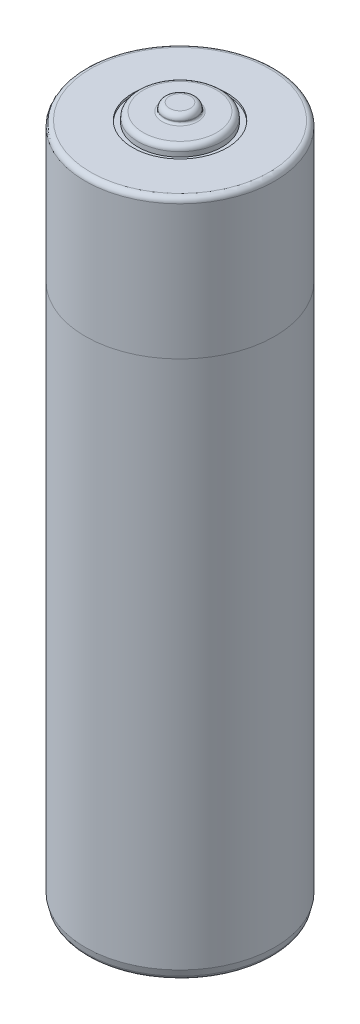
ISO-10303-21;
HEADER;
FILE_DESCRIPTION(('STEP AP214'),'2;1');
FILE_NAME('part.step','',(''),(''),'','','');
FILE_SCHEMA(('AUTOMOTIVE_DESIGN { 1 0 10303 214 1 1 1 1 }'));
ENDSEC;
DATA;
#1=APPLICATION_CONTEXT('core data for automotive mechanical design processes');
#2=APPLICATION_PROTOCOL_DEFINITION('international standard','automotive_design',2000,#1);
#3=PRODUCT_CONTEXT('',#1,'mechanical');
#4=PRODUCT('Part','Part','',(#3));
#5=PRODUCT_RELATED_PRODUCT_CATEGORY('part','',(#4));
#6=PRODUCT_DEFINITION_FORMATION('','',#4);
#7=PRODUCT_DEFINITION_CONTEXT('part definition',#1,'design');
#8=PRODUCT_DEFINITION('design','',#6,#7);
#9=PRODUCT_DEFINITION_SHAPE('','',#8);
#10=(LENGTH_UNIT() NAMED_UNIT(*) SI_UNIT(.MILLI.,.METRE.));
#11=(NAMED_UNIT(*) PLANE_ANGLE_UNIT() SI_UNIT($,.RADIAN.));
#12=(NAMED_UNIT(*) SI_UNIT($,.STERADIAN.) SOLID_ANGLE_UNIT());
#13=UNCERTAINTY_MEASURE_WITH_UNIT(LENGTH_MEASURE(1.E-05),#10,'distance_accuracy_value','');
#14=(GEOMETRIC_REPRESENTATION_CONTEXT(3) GLOBAL_UNCERTAINTY_ASSIGNED_CONTEXT((#13)) GLOBAL_UNIT_ASSIGNED_CONTEXT((#10,
#11,#12)) REPRESENTATION_CONTEXT('',''));
#15=CARTESIAN_POINT('',(0.,0.,0.));
#16=DIRECTION('',(0.,0.,1.));
#17=DIRECTION('',(1.,0.,0.));
#18=AXIS2_PLACEMENT_3D('',#15,#16,#17);
#19=CARTESIAN_POINT('',(0.,64.7,0.));
#20=DIRECTION('',(0.,-1.,0.));
#21=DIRECTION('',(0.,0.,-1.));
#22=AXIS2_PLACEMENT_3D('',#19,#20,#21);
#23=CYLINDRICAL_SURFACE('',#22,9.025);
#24=CARTESIAN_POINT('',(0.,64.2,0.));
#25=DIRECTION('',(0.,1.,0.));
#26=DIRECTION('',(0.,0.,1.));
#27=AXIS2_PLACEMENT_3D('',#24,#25,#26);
#28=CIRCLE('',#27,9.025);
#29=CARTESIAN_POINT('',(0.,64.2,9.025));
#30=VERTEX_POINT('',#29);
#31=EDGE_CURVE('E75',#30,#30,#28,.F.);
#32=ORIENTED_EDGE('',*,*,#31,.T.);
#33=EDGE_LOOP('',(#32));
#34=FACE_BOUND('',#33,.T.);
#35=CARTESIAN_POINT('',(0.,51.4,0.));
#36=DIRECTION('',(0.,1.,0.));
#37=DIRECTION('',(0.,0.,1.));
#38=AXIS2_PLACEMENT_3D('',#35,#36,#37);
#39=CIRCLE('',#38,9.025);
#40=CARTESIAN_POINT('',(0.,51.4,9.025));
#41=VERTEX_POINT('',#40);
#42=EDGE_CURVE('E11',#41,#41,#39,.T.);
#43=ORIENTED_EDGE('',*,*,#42,.T.);
#44=EDGE_LOOP('',(#43));
#45=FACE_BOUND('',#44,.T.);
#46=ADVANCED_FACE('F46',(#34,#45),#23,.T.);
#47=ORIENTED_EDGE('',*,*,#42,.F.);
#48=EDGE_LOOP('',(#47));
#49=FACE_BOUND('',#48,.T.);
#50=CARTESIAN_POINT('',(0.,1.,0.));
#51=DIRECTION('',(0.,1.,0.));
#52=DIRECTION('',(0.,0.,1.));
#53=AXIS2_PLACEMENT_3D('',#50,#51,#52);
#54=CIRCLE('',#53,9.025);
#55=CARTESIAN_POINT('',(0.,1.,9.025));
#56=VERTEX_POINT('',#55);
#57=EDGE_CURVE('E102',#56,#56,#54,.T.);
#58=ORIENTED_EDGE('',*,*,#57,.T.);
#59=EDGE_LOOP('',(#58));
#60=FACE_BOUND('',#59,.T.);
#61=ADVANCED_FACE('F133',(#49,#60),#23,.T.);
#62=CARTESIAN_POINT('',(0.,64.7,0.));
#63=DIRECTION('',(0.,1.,0.));
#64=DIRECTION('',(0.,0.,1.));
#65=AXIS2_PLACEMENT_3D('',#62,#63,#64);
#66=PLANE('',#65);
#67=CARTESIAN_POINT('',(0.,64.7,0.));
#68=DIRECTION('',(0.,1.,0.));
#69=DIRECTION('',(0.,0.,1.));
#70=AXIS2_PLACEMENT_3D('',#67,#68,#69);
#71=CIRCLE('',#70,8.525);
#72=CARTESIAN_POINT('',(0.,64.7,8.525));
#73=VERTEX_POINT('',#72);
#74=EDGE_CURVE('E78',#73,#73,#71,.T.);
#75=ORIENTED_EDGE('',*,*,#74,.T.);
#76=EDGE_LOOP('',(#75));
#77=FACE_BOUND('',#76,.T.);
#78=CARTESIAN_POINT('',(0.,64.7,0.));
#79=DIRECTION('',(0.,1.,0.));
#80=DIRECTION('',(0.,0.,1.));
#81=AXIS2_PLACEMENT_3D('',#78,#79,#80);
#82=CIRCLE('',#81,4.5);
#83=CARTESIAN_POINT('',(0.,64.7,4.5));
#84=VERTEX_POINT('',#83);
#85=EDGE_CURVE('E94',#84,#84,#82,.T.);
#86=ORIENTED_EDGE('',*,*,#85,.F.);
#87=EDGE_LOOP('',(#86));
#88=FACE_BOUND('',#87,.T.);
#89=ADVANCED_FACE('F139',(#77,#88),#66,.T.);
#90=CARTESIAN_POINT('',(0.,64.5,0.));
#91=DIRECTION('',(0.,1.,0.));
#92=DIRECTION('',(0.,0.,1.));
#93=AXIS2_PLACEMENT_3D('',#90,#91,#92);
#94=CYLINDRICAL_SURFACE('',#93,4.5);
#95=CARTESIAN_POINT('',(0.,64.5,0.));
#96=DIRECTION('',(0.,1.,0.));
#97=DIRECTION('',(0.,0.,1.));
#98=AXIS2_PLACEMENT_3D('',#95,#96,#97);
#99=CIRCLE('',#98,4.5);
#100=CARTESIAN_POINT('',(0.,64.5,4.5));
#101=VERTEX_POINT('',#100);
#102=EDGE_CURVE('E93',#101,#101,#99,.T.);
#103=ORIENTED_EDGE('',*,*,#102,.F.);
#104=EDGE_LOOP('',(#103));
#105=FACE_BOUND('',#104,.T.);
#106=ORIENTED_EDGE('',*,*,#85,.T.);
#107=EDGE_LOOP('',(#106));
#108=FACE_BOUND('',#107,.T.);
#109=ADVANCED_FACE('F210',(#105,#108),#94,.F.);
#110=CARTESIAN_POINT('',(0.,64.5,0.));
#111=DIRECTION('',(0.,1.,0.));
#112=DIRECTION('',(0.,0.,1.));
#113=AXIS2_PLACEMENT_3D('',#110,#111,#112);
#114=PLANE('',#113);
#115=CARTESIAN_POINT('',(0.,64.5,0.));
#116=DIRECTION('',(0.,1.,0.));
#117=DIRECTION('',(1.,0.,0.));
#118=AXIS2_PLACEMENT_3D('',#115,#116,#117);
#119=CIRCLE('',#118,4.);
#120=CARTESIAN_POINT('',(4.,64.5,0.));
#121=VERTEX_POINT('',#120);
#122=EDGE_CURVE('E97',#121,#121,#119,.T.);
#123=ORIENTED_EDGE('',*,*,#122,.F.);
#124=EDGE_LOOP('',(#123));
#125=FACE_BOUND('',#124,.T.);
#126=ORIENTED_EDGE('',*,*,#102,.T.);
#127=EDGE_LOOP('',(#126));
#128=FACE_BOUND('',#127,.T.);
#129=ADVANCED_FACE('F206',(#125,#128),#114,.T.);
#130=CARTESIAN_POINT('',(0.,64.5,0.));
#131=DIRECTION('',(0.,1.,0.));
#132=DIRECTION('',(0.,0.,1.));
#133=AXIS2_PLACEMENT_3D('',#130,#131,#132);
#134=CYLINDRICAL_SURFACE('',#133,4.);
#135=CARTESIAN_POINT('',(0.,64.95,0.));
#136=DIRECTION('',(0.,1.,0.));
#137=DIRECTION('',(0.,0.,1.));
#138=AXIS2_PLACEMENT_3D('',#135,#136,#137);
#139=CIRCLE('',#138,4.);
#140=CARTESIAN_POINT('',(0.,64.95,4.));
#141=VERTEX_POINT('',#140);
#142=EDGE_CURVE('E81',#141,#141,#139,.F.);
#143=ORIENTED_EDGE('',*,*,#142,.T.);
#144=EDGE_LOOP('',(#143));
#145=FACE_BOUND('',#144,.T.);
#146=ORIENTED_EDGE('',*,*,#122,.T.);
#147=EDGE_LOOP('',(#146));
#148=FACE_BOUND('',#147,.T.);
#149=ADVANCED_FACE('F200',(#145,#148),#134,.T.);
#150=CARTESIAN_POINT('',(0.,65.45,0.));
#151=DIRECTION('',(0.,1.,0.));
#152=DIRECTION('',(0.,0.,1.));
#153=AXIS2_PLACEMENT_3D('',#150,#151,#152);
#154=PLANE('',#153);
#155=CARTESIAN_POINT('',(0.,65.45,0.));
#156=DIRECTION('',(0.,1.,0.));
#157=DIRECTION('',(0.,0.,1.));
#158=AXIS2_PLACEMENT_3D('',#155,#156,#157);
#159=CIRCLE('',#158,1.7);
#160=CARTESIAN_POINT('',(0.,65.45,1.7));
#161=VERTEX_POINT('',#160);
#162=EDGE_CURVE('E53',#161,#161,#159,.F.);
#163=ORIENTED_EDGE('',*,*,#162,.T.);
#164=EDGE_LOOP('',(#163));
#165=FACE_BOUND('',#164,.T.);
#166=CARTESIAN_POINT('',(0.,65.45,0.));
#167=DIRECTION('',(0.,1.,0.));
#168=DIRECTION('',(0.,0.,1.));
#169=AXIS2_PLACEMENT_3D('',#166,#167,#168);
#170=CIRCLE('',#169,3.5);
#171=CARTESIAN_POINT('',(0.,65.45,3.5));
#172=VERTEX_POINT('',#171);
#173=EDGE_CURVE('E84',#172,#172,#170,.T.);
#174=ORIENTED_EDGE('',*,*,#173,.T.);
#175=EDGE_LOOP('',(#174));
#176=FACE_BOUND('',#175,.T.);
#177=ADVANCED_FACE('F197',(#165,#176),#154,.T.);
#178=CARTESIAN_POINT('',(0.,66.2,0.));
#179=DIRECTION('',(0.,1.,0.));
#180=DIRECTION('',(0.,0.,1.));
#181=AXIS2_PLACEMENT_3D('',#178,#179,#180);
#182=PLANE('',#181);
#183=CARTESIAN_POINT('',(0.,66.2,0.));
#184=DIRECTION('',(0.,1.,0.));
#185=DIRECTION('',(0.,0.,1.));
#186=AXIS2_PLACEMENT_3D('',#183,#184,#185);
#187=CIRCLE('',#186,1.);
#188=CARTESIAN_POINT('',(0.,66.2,1.));
#189=VERTEX_POINT('',#188);
#190=EDGE_CURVE('E72',#189,#189,#187,.T.);
#191=ORIENTED_EDGE('',*,*,#190,.T.);
#192=EDGE_LOOP('',(#191));
#193=FACE_BOUND('',#192,.T.);
#194=ADVANCED_FACE('F193',(#193),#182,.T.);
#195=CARTESIAN_POINT('',(0.,66.2,0.));
#196=DIRECTION('',(0.,-1.,0.));
#197=DIRECTION('',(0.,0.,-1.));
#198=AXIS2_PLACEMENT_3D('',#195,#196,#197);
#199=CYLINDRICAL_SURFACE('',#198,1.5);
#200=CARTESIAN_POINT('',(0.,65.65,0.));
#201=DIRECTION('',(0.,1.,0.));
#202=DIRECTION('',(0.,0.,1.));
#203=AXIS2_PLACEMENT_3D('',#200,#201,#202);
#204=CIRCLE('',#203,1.5);
#205=CARTESIAN_POINT('',(0.,65.65,1.5));
#206=VERTEX_POINT('',#205);
#207=EDGE_CURVE('E57',#206,#206,#204,.T.);
#208=ORIENTED_EDGE('',*,*,#207,.T.);
#209=EDGE_LOOP('',(#208));
#210=FACE_BOUND('',#209,.T.);
#211=CARTESIAN_POINT('',(0.,65.7,0.));
#212=DIRECTION('',(0.,1.,0.));
#213=DIRECTION('',(0.,0.,1.));
#214=AXIS2_PLACEMENT_3D('',#211,#212,#213);
#215=CIRCLE('',#214,1.5);
#216=CARTESIAN_POINT('',(0.,65.7,1.5));
#217=VERTEX_POINT('',#216);
#218=EDGE_CURVE('E69',#217,#217,#215,.F.);
#219=ORIENTED_EDGE('',*,*,#218,.T.);
#220=EDGE_LOOP('',(#219));
#221=FACE_BOUND('',#220,.T.);
#222=ADVANCED_FACE('F181',(#210,#221),#199,.T.);
#223=CARTESIAN_POINT('',(0.,1.,0.));
#224=DIRECTION('',(0.,1.,0.));
#225=DIRECTION('',(0.,0.,1.));
#226=AXIS2_PLACEMENT_3D('',#223,#224,#225);
#227=CONICAL_SURFACE('',#226,9.025,0.244978663126864);
#228=CARTESIAN_POINT('',(0.,0.378732187481834,0.));
#229=DIRECTION('',(0.,1.,0.));
#230=DIRECTION('',(0.,0.,1.));
#231=AXIS2_PLACEMENT_3D('',#228,#229,#230);
#232=CIRCLE('',#231,8.86968304687046);
#233=CARTESIAN_POINT('',(0.,0.378732187481834,8.86968304687046));
#234=VERTEX_POINT('',#233);
#235=EDGE_CURVE('E90',#234,#234,#232,.T.);
#236=ORIENTED_EDGE('',*,*,#235,.T.);
#237=EDGE_LOOP('',(#236));
#238=FACE_BOUND('',#237,.T.);
#239=ORIENTED_EDGE('',*,*,#57,.F.);
#240=EDGE_LOOP('',(#239));
#241=FACE_BOUND('',#240,.T.);
#242=ADVANCED_FACE('F176',(#238,#241),#227,.T.);
#243=CARTESIAN_POINT('',(0.,0.,0.));
#244=DIRECTION('',(0.,1.,0.));
#245=DIRECTION('',(0.,0.,1.));
#246=AXIS2_PLACEMENT_3D('',#243,#244,#245);
#247=PLANE('',#246);
#248=CARTESIAN_POINT('',(0.,0.,0.));
#249=DIRECTION('',(0.,1.,0.));
#250=DIRECTION('',(0.,0.,1.));
#251=AXIS2_PLACEMENT_3D('',#248,#249,#250);
#252=CIRCLE('',#251,8.38461179679779);
#253=CARTESIAN_POINT('',(0.,0.,8.38461179679779));
#254=VERTEX_POINT('',#253);
#255=EDGE_CURVE('E87',#254,#254,#252,.F.);
#256=ORIENTED_EDGE('',*,*,#255,.T.);
#257=EDGE_LOOP('',(#256));
#258=FACE_BOUND('',#257,.T.);
#259=CARTESIAN_POINT('',(0.,0.,0.));
#260=DIRECTION('',(0.,-1.,0.));
#261=DIRECTION('',(0.,0.,-1.));
#262=AXIS2_PLACEMENT_3D('',#259,#260,#261);
#263=CIRCLE('',#262,3.35);
#264=CARTESIAN_POINT('',(0.,0.,-3.35));
#265=VERTEX_POINT('',#264);
#266=EDGE_CURVE('E106',#265,#265,#263,.T.);
#267=ORIENTED_EDGE('',*,*,#266,.F.);
#268=EDGE_LOOP('',(#267));
#269=FACE_BOUND('',#268,.T.);
#270=ADVANCED_FACE('F128',(#258,#269),#247,.F.);
#271=CARTESIAN_POINT('',(0.,0.5,0.));
#272=DIRECTION('',(0.,-1.,0.));
#273=DIRECTION('',(0.,0.,-1.));
#274=AXIS2_PLACEMENT_3D('',#271,#272,#273);
#275=CYLINDRICAL_SURFACE('',#274,3.35);
#276=CARTESIAN_POINT('',(0.,0.5,0.));
#277=DIRECTION('',(0.,-1.,0.));
#278=DIRECTION('',(0.,0.,-1.));
#279=AXIS2_PLACEMENT_3D('',#276,#277,#278);
#280=CIRCLE('',#279,3.35);
#281=CARTESIAN_POINT('',(0.,0.5,-3.35));
#282=VERTEX_POINT('',#281);
#283=EDGE_CURVE('E105',#282,#282,#280,.T.);
#284=ORIENTED_EDGE('',*,*,#283,.F.);
#285=EDGE_LOOP('',(#284));
#286=FACE_BOUND('',#285,.T.);
#287=ORIENTED_EDGE('',*,*,#266,.T.);
#288=EDGE_LOOP('',(#287));
#289=FACE_BOUND('',#288,.T.);
#290=ADVANCED_FACE('F129',(#286,#289),#275,.F.);
#291=CARTESIAN_POINT('',(0.,0.5,0.));
#292=DIRECTION('',(0.,-1.,0.));
#293=DIRECTION('',(0.,0.,-1.));
#294=AXIS2_PLACEMENT_3D('',#291,#292,#293);
#295=PLANE('',#294);
#296=CARTESIAN_POINT('',(0.,0.5,0.));
#297=DIRECTION('',(0.,-1.,0.));
#298=DIRECTION('',(0.,0.,-1.));
#299=AXIS2_PLACEMENT_3D('',#296,#297,#298);
#300=CIRCLE('',#299,2.95);
#301=CARTESIAN_POINT('',(0.,0.5,-2.95));
#302=VERTEX_POINT('',#301);
#303=EDGE_CURVE('E61',#302,#302,#300,.F.);
#304=ORIENTED_EDGE('',*,*,#303,.T.);
#305=EDGE_LOOP('',(#304));
#306=FACE_BOUND('',#305,.T.);
#307=ORIENTED_EDGE('',*,*,#283,.T.);
#308=EDGE_LOOP('',(#307));
#309=FACE_BOUND('',#308,.T.);
#310=ADVANCED_FACE('F119',(#306,#309),#295,.T.);
#311=CARTESIAN_POINT('',(0.,0.5,0.));
#312=DIRECTION('',(0.,-1.,0.));
#313=DIRECTION('',(0.,0.,-1.));
#314=AXIS2_PLACEMENT_3D('',#311,#312,#313);
#315=CYLINDRICAL_SURFACE('',#314,2.75);
#316=CARTESIAN_POINT('',(0.,0.3,0.));
#317=DIRECTION('',(0.,-1.,0.));
#318=DIRECTION('',(0.,0.,-1.));
#319=AXIS2_PLACEMENT_3D('',#316,#317,#318);
#320=CIRCLE('',#319,2.75);
#321=CARTESIAN_POINT('',(0.,0.3,-2.75));
#322=VERTEX_POINT('',#321);
#323=EDGE_CURVE('E66',#322,#322,#320,.T.);
#324=ORIENTED_EDGE('',*,*,#323,.T.);
#325=EDGE_LOOP('',(#324));
#326=FACE_BOUND('',#325,.T.);
#327=CARTESIAN_POINT('',(0.,0.,0.));
#328=DIRECTION('',(0.,-1.,0.));
#329=DIRECTION('',(1.,0.,0.));
#330=AXIS2_PLACEMENT_3D('',#327,#328,#329);
#331=CIRCLE('',#330,2.75);
#332=CARTESIAN_POINT('',(2.75,0.,0.));
#333=VERTEX_POINT('',#332);
#334=EDGE_CURVE('E109',#333,#333,#331,.T.);
#335=ORIENTED_EDGE('',*,*,#334,.F.);
#336=EDGE_LOOP('',(#335));
#337=FACE_BOUND('',#336,.T.);
#338=ADVANCED_FACE('F117',(#326,#337),#315,.T.);
#339=ORIENTED_EDGE('',*,*,#334,.T.);
#340=EDGE_LOOP('',(#339));
#341=FACE_BOUND('',#340,.T.);
#342=ADVANCED_FACE('F115',(#341),#247,.F.);
#343=CARTESIAN_POINT('',(0.,0.5,0.));
#344=DIRECTION('',(0.,1.,0.));
#345=DIRECTION('',(0.,0.,1.));
#346=AXIS2_PLACEMENT_3D('',#343,#344,#345);
#347=TOROIDAL_SURFACE('',#346,8.38461179679779,0.5);
#348=ORIENTED_EDGE('',*,*,#255,.F.);
#349=EDGE_LOOP('',(#348));
#350=FACE_BOUND('',#349,.T.);
#351=ORIENTED_EDGE('',*,*,#235,.F.);
#352=EDGE_LOOP('',(#351));
#353=FACE_BOUND('',#352,.T.);
#354=ADVANCED_FACE('F126',(#350,#353),#347,.T.);
#355=CARTESIAN_POINT('',(0.,64.95,0.));
#356=DIRECTION('',(0.,1.,0.));
#357=DIRECTION('',(0.,0.,1.));
#358=AXIS2_PLACEMENT_3D('',#355,#356,#357);
#359=TOROIDAL_SURFACE('',#358,3.5,0.5);
#360=ORIENTED_EDGE('',*,*,#142,.F.);
#361=EDGE_LOOP('',(#360));
#362=FACE_BOUND('',#361,.T.);
#363=ORIENTED_EDGE('',*,*,#173,.F.);
#364=EDGE_LOOP('',(#363));
#365=FACE_BOUND('',#364,.T.);
#366=ADVANCED_FACE('F145',(#362,#365),#359,.T.);
#367=CARTESIAN_POINT('',(0.,64.2,0.));
#368=DIRECTION('',(0.,1.,0.));
#369=DIRECTION('',(0.,0.,1.));
#370=AXIS2_PLACEMENT_3D('',#367,#368,#369);
#371=TOROIDAL_SURFACE('',#370,8.525,0.5);
#372=ORIENTED_EDGE('',*,*,#31,.F.);
#373=EDGE_LOOP('',(#372));
#374=FACE_BOUND('',#373,.T.);
#375=ORIENTED_EDGE('',*,*,#74,.F.);
#376=EDGE_LOOP('',(#375));
#377=FACE_BOUND('',#376,.T.);
#378=ADVANCED_FACE('F149',(#374,#377),#371,.T.);
#379=CARTESIAN_POINT('',(0.,65.7,0.));
#380=DIRECTION('',(0.,1.,0.));
#381=DIRECTION('',(0.,0.,1.));
#382=AXIS2_PLACEMENT_3D('',#379,#380,#381);
#383=TOROIDAL_SURFACE('',#382,1.,0.5);
#384=ORIENTED_EDGE('',*,*,#218,.F.);
#385=EDGE_LOOP('',(#384));
#386=FACE_BOUND('',#385,.T.);
#387=ORIENTED_EDGE('',*,*,#190,.F.);
#388=EDGE_LOOP('',(#387));
#389=FACE_BOUND('',#388,.T.);
#390=ADVANCED_FACE('F153',(#386,#389),#383,.T.);
#391=CARTESIAN_POINT('',(0.,0.3,0.));
#392=DIRECTION('',(0.,-1.,0.));
#393=DIRECTION('',(0.,0.,-1.));
#394=AXIS2_PLACEMENT_3D('',#391,#392,#393);
#395=TOROIDAL_SURFACE('',#394,2.95,0.2);
#396=ORIENTED_EDGE('',*,*,#303,.F.);
#397=EDGE_LOOP('',(#396));
#398=FACE_BOUND('',#397,.T.);
#399=ORIENTED_EDGE('',*,*,#323,.F.);
#400=EDGE_LOOP('',(#399));
#401=FACE_BOUND('',#400,.T.);
#402=ADVANCED_FACE('F156',(#398,#401),#395,.F.);
#403=CARTESIAN_POINT('',(0.,65.65,0.));
#404=DIRECTION('',(0.,1.,0.));
#405=DIRECTION('',(0.,0.,1.));
#406=AXIS2_PLACEMENT_3D('',#403,#404,#405);
#407=TOROIDAL_SURFACE('',#406,1.7,0.2);
#408=ORIENTED_EDGE('',*,*,#162,.F.);
#409=EDGE_LOOP('',(#408));
#410=FACE_BOUND('',#409,.T.);
#411=ORIENTED_EDGE('',*,*,#207,.F.);
#412=EDGE_LOOP('',(#411));
#413=FACE_BOUND('',#412,.T.);
#414=ADVANCED_FACE('F48',(#410,#413),#407,.F.);
#415=CLOSED_SHELL('',(#46,#61,#89,#109,#129,#149,#177,#194,#222,#242,#270,#290,#310,#338,#342,
#354,#366,#378,#390,#402,#414));
#416=MANIFOLD_SOLID_BREP('B2',#415);
#417=ADVANCED_BREP_SHAPE_REPRESENTATION('',(#18,#416),#14);
#418=SHAPE_DEFINITION_REPRESENTATION(#9,#417);
ENDSEC;
END-ISO-10303-21;
